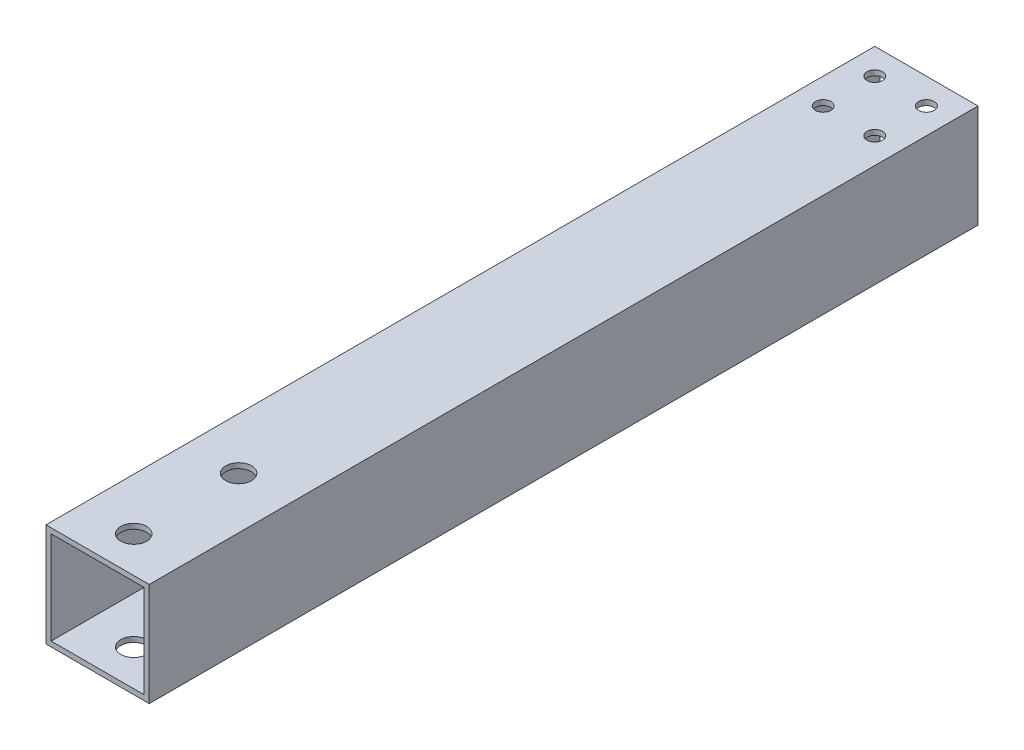
ISO-10303-21;
HEADER;
FILE_DESCRIPTION(('STEP AP214'),'2;1');
FILE_NAME('part.step','',(''),(''),'','','');
FILE_SCHEMA(('AUTOMOTIVE_DESIGN { 1 0 10303 214 1 1 1 1 }'));
ENDSEC;
DATA;
#1=APPLICATION_CONTEXT('core data for automotive mechanical design processes');
#2=APPLICATION_PROTOCOL_DEFINITION('international standard','automotive_design',2000,#1);
#3=PRODUCT_CONTEXT('',#1,'mechanical');
#4=PRODUCT('Part','Part','',(#3));
#5=PRODUCT_RELATED_PRODUCT_CATEGORY('part','',(#4));
#6=PRODUCT_DEFINITION_FORMATION('','',#4);
#7=PRODUCT_DEFINITION_CONTEXT('part definition',#1,'design');
#8=PRODUCT_DEFINITION('design','',#6,#7);
#9=PRODUCT_DEFINITION_SHAPE('','',#8);
#10=(LENGTH_UNIT() NAMED_UNIT(*) SI_UNIT(.MILLI.,.METRE.));
#11=(NAMED_UNIT(*) PLANE_ANGLE_UNIT() SI_UNIT($,.RADIAN.));
#12=(NAMED_UNIT(*) SI_UNIT($,.STERADIAN.) SOLID_ANGLE_UNIT());
#13=UNCERTAINTY_MEASURE_WITH_UNIT(LENGTH_MEASURE(1.E-05),#10,'distance_accuracy_value','');
#14=(GEOMETRIC_REPRESENTATION_CONTEXT(3) GLOBAL_UNCERTAINTY_ASSIGNED_CONTEXT((#13)) GLOBAL_UNIT_ASSIGNED_CONTEXT((#10,
#11,#12)) REPRESENTATION_CONTEXT('',''));
#15=CARTESIAN_POINT('',(0.,0.,0.));
#16=DIRECTION('',(0.,0.,1.));
#17=DIRECTION('',(1.,0.,0.));
#18=AXIS2_PLACEMENT_3D('',#15,#16,#17);
#19=CARTESIAN_POINT('',(10.,10.,171.98));
#20=DIRECTION('',(-1.,0.,0.));
#21=DIRECTION('',(0.,-1.,0.));
#22=AXIS2_PLACEMENT_3D('',#19,#20,#21);
#23=PLANE('',#22);
#24=DIRECTION('',(0.,1.,0.));
#25=VECTOR('',#24,1.);
#26=CARTESIAN_POINT('',(10.,-23.,160.58));
#27=LINE('',#26,#25);
#28=CARTESIAN_POINT('',(10.,-10.,160.58));
#29=VERTEX_POINT('',#28);
#30=CARTESIAN_POINT('',(10.,10.,160.58));
#31=VERTEX_POINT('',#30);
#32=EDGE_CURVE('E98',#29,#31,#27,.T.);
#33=ORIENTED_EDGE('',*,*,#32,.F.);
#34=DIRECTION('',(0.,0.,-1.));
#35=VECTOR('',#34,1.);
#36=CARTESIAN_POINT('',(10.,-10.,171.98));
#37=LINE('',#36,#35);
#38=CARTESIAN_POINT('',(10.,-10.,0.));
#39=VERTEX_POINT('',#38);
#40=EDGE_CURVE('E118',#29,#39,#37,.T.);
#41=ORIENTED_EDGE('',*,*,#40,.T.);
#42=DIRECTION('',(0.,1.,0.));
#43=VECTOR('',#42,1.);
#44=CARTESIAN_POINT('',(10.,10.,0.));
#45=LINE('',#44,#43);
#46=CARTESIAN_POINT('',(10.,10.,0.));
#47=VERTEX_POINT('',#46);
#48=EDGE_CURVE('E213',#39,#47,#45,.T.);
#49=ORIENTED_EDGE('',*,*,#48,.T.);
#50=DIRECTION('',(0.,0.,-1.));
#51=VECTOR('',#50,1.);
#52=CARTESIAN_POINT('',(10.,10.,171.98));
#53=LINE('',#52,#51);
#54=EDGE_CURVE('E41',#31,#47,#53,.T.);
#55=ORIENTED_EDGE('',*,*,#54,.F.);
#56=EDGE_LOOP('',(#33,#41,#49,#55));
#57=FACE_BOUND('',#56,.T.);
#58=ADVANCED_FACE('F34',(#57),#23,.F.);
#59=CARTESIAN_POINT('',(-9.99999999999999,10.,171.98));
#60=DIRECTION('',(0.,-1.,0.));
#61=DIRECTION('',(0.,0.,-1.));
#62=AXIS2_PLACEMENT_3D('',#59,#60,#61);
#63=PLANE('',#62);
#64=CARTESIAN_POINT('',(-4.99999999999999,10.,5.));
#65=DIRECTION('',(0.,1.,0.));
#66=DIRECTION('',(0.,0.,1.));
#67=AXIS2_PLACEMENT_3D('',#64,#65,#66);
#68=CIRCLE('',#67,1.5);
#69=CARTESIAN_POINT('',(-4.99999999999999,10.,6.5));
#70=VERTEX_POINT('',#69);
#71=EDGE_CURVE('E126',#70,#70,#68,.T.);
#72=ORIENTED_EDGE('',*,*,#71,.F.);
#73=EDGE_LOOP('',(#72));
#74=FACE_BOUND('',#73,.T.);
#75=CARTESIAN_POINT('',(5.00000000000001,10.,5.));
#76=DIRECTION('',(0.,1.,0.));
#77=DIRECTION('',(0.,0.,1.));
#78=AXIS2_PLACEMENT_3D('',#75,#76,#77);
#79=CIRCLE('',#78,1.5);
#80=CARTESIAN_POINT('',(5.00000000000001,10.,6.5));
#81=VERTEX_POINT('',#80);
#82=EDGE_CURVE('E169',#81,#81,#79,.T.);
#83=ORIENTED_EDGE('',*,*,#82,.F.);
#84=EDGE_LOOP('',(#83));
#85=FACE_BOUND('',#84,.T.);
#86=CARTESIAN_POINT('',(-4.99999999999999,10.,15.));
#87=DIRECTION('',(0.,1.,0.));
#88=DIRECTION('',(0.,0.,1.));
#89=AXIS2_PLACEMENT_3D('',#86,#87,#88);
#90=CIRCLE('',#89,1.5);
#91=CARTESIAN_POINT('',(-4.99999999999999,10.,16.5));
#92=VERTEX_POINT('',#91);
#93=EDGE_CURVE('E168',#92,#92,#90,.T.);
#94=ORIENTED_EDGE('',*,*,#93,.F.);
#95=EDGE_LOOP('',(#94));
#96=FACE_BOUND('',#95,.T.);
#97=CARTESIAN_POINT('',(5.00000000000001,10.,15.));
#98=DIRECTION('',(0.,1.,0.));
#99=DIRECTION('',(0.,0.,1.));
#100=AXIS2_PLACEMENT_3D('',#97,#98,#99);
#101=CIRCLE('',#100,1.5);
#102=CARTESIAN_POINT('',(5.00000000000001,10.,16.5));
#103=VERTEX_POINT('',#102);
#104=EDGE_CURVE('E165',#103,#103,#101,.T.);
#105=ORIENTED_EDGE('',*,*,#104,.F.);
#106=EDGE_LOOP('',(#105));
#107=FACE_BOUND('',#106,.T.);
#108=CARTESIAN_POINT('',(0.,10.,133.26));
#109=DIRECTION('',(0.,1.,0.));
#110=DIRECTION('',(0.,0.,1.));
#111=AXIS2_PLACEMENT_3D('',#108,#109,#110);
#112=CIRCLE('',#111,2.5);
#113=CARTESIAN_POINT('',(0.,10.,135.76));
#114=VERTEX_POINT('',#113);
#115=EDGE_CURVE('E259',#114,#114,#112,.T.);
#116=ORIENTED_EDGE('',*,*,#115,.F.);
#117=EDGE_LOOP('',(#116));
#118=FACE_BOUND('',#117,.T.);
#119=CARTESIAN_POINT('',(0.,10.,153.58));
#120=DIRECTION('',(0.,1.,0.));
#121=DIRECTION('',(0.,0.,1.));
#122=AXIS2_PLACEMENT_3D('',#119,#120,#121);
#123=CIRCLE('',#122,2.5);
#124=CARTESIAN_POINT('',(0.,10.,156.08));
#125=VERTEX_POINT('',#124);
#126=EDGE_CURVE('E145',#125,#125,#123,.T.);
#127=ORIENTED_EDGE('',*,*,#126,.F.);
#128=EDGE_LOOP('',(#127));
#129=FACE_BOUND('',#128,.T.);
#130=DIRECTION('',(1.,0.,0.));
#131=VECTOR('',#130,1.);
#132=CARTESIAN_POINT('',(-9.99999999999999,10.,160.58));
#133=LINE('',#132,#131);
#134=CARTESIAN_POINT('',(-9.99999999999999,10.,160.58));
#135=VERTEX_POINT('',#134);
#136=EDGE_CURVE('E95',#135,#31,#133,.T.);
#137=ORIENTED_EDGE('',*,*,#136,.T.);
#138=ORIENTED_EDGE('',*,*,#54,.T.);
#139=DIRECTION('',(-1.,0.,0.));
#140=VECTOR('',#139,1.);
#141=CARTESIAN_POINT('',(-9.99999999999999,10.,0.));
#142=LINE('',#141,#140);
#143=CARTESIAN_POINT('',(-9.99999999999999,10.,0.));
#144=VERTEX_POINT('',#143);
#145=EDGE_CURVE('E114',#47,#144,#142,.T.);
#146=ORIENTED_EDGE('',*,*,#145,.T.);
#147=DIRECTION('',(0.,0.,-1.));
#148=VECTOR('',#147,1.);
#149=CARTESIAN_POINT('',(-9.99999999999999,10.,171.98));
#150=LINE('',#149,#148);
#151=EDGE_CURVE('E107',#135,#144,#150,.T.);
#152=ORIENTED_EDGE('',*,*,#151,.F.);
#153=EDGE_LOOP('',(#137,#138,#146,#152));
#154=FACE_BOUND('',#153,.T.);
#155=ADVANCED_FACE('F112',(#74,#85,#96,#107,#118,#129,#154),#63,.F.);
#156=CARTESIAN_POINT('',(-9.99999999999999,10.,171.98));
#157=DIRECTION('',(1.,0.,0.));
#158=DIRECTION('',(0.,0.,-1.));
#159=AXIS2_PLACEMENT_3D('',#156,#157,#158);
#160=PLANE('',#159);
#161=DIRECTION('',(0.,1.,0.));
#162=VECTOR('',#161,1.);
#163=CARTESIAN_POINT('',(-9.99999999999999,-23.,160.58));
#164=LINE('',#163,#162);
#165=CARTESIAN_POINT('',(-9.99999999999999,-10.,160.58));
#166=VERTEX_POINT('',#165);
#167=EDGE_CURVE('E48',#166,#135,#164,.T.);
#168=ORIENTED_EDGE('',*,*,#167,.T.);
#169=ORIENTED_EDGE('',*,*,#151,.T.);
#170=DIRECTION('',(0.,-1.,0.));
#171=VECTOR('',#170,1.);
#172=CARTESIAN_POINT('',(-9.99999999999999,10.,0.));
#173=LINE('',#172,#171);
#174=CARTESIAN_POINT('',(-9.99999999999999,-10.,0.));
#175=VERTEX_POINT('',#174);
#176=EDGE_CURVE('E217',#144,#175,#173,.T.);
#177=ORIENTED_EDGE('',*,*,#176,.T.);
#178=DIRECTION('',(0.,0.,-1.));
#179=VECTOR('',#178,1.);
#180=CARTESIAN_POINT('',(-9.99999999999999,-10.,171.98));
#181=LINE('',#180,#179);
#182=EDGE_CURVE('E109',#166,#175,#181,.T.);
#183=ORIENTED_EDGE('',*,*,#182,.F.);
#184=EDGE_LOOP('',(#168,#169,#177,#183));
#185=FACE_BOUND('',#184,.T.);
#186=ADVANCED_FACE('F105',(#185),#160,.F.);
#187=CARTESIAN_POINT('',(-9.99999999999999,-10.,171.98));
#188=DIRECTION('',(0.,1.,0.));
#189=DIRECTION('',(0.,0.,1.));
#190=AXIS2_PLACEMENT_3D('',#187,#188,#189);
#191=PLANE('',#190);
#192=CARTESIAN_POINT('',(-4.99999999999999,-10.,5.));
#193=DIRECTION('',(0.,1.,0.));
#194=DIRECTION('',(0.,0.,1.));
#195=AXIS2_PLACEMENT_3D('',#192,#193,#194);
#196=CIRCLE('',#195,1.5);
#197=CARTESIAN_POINT('',(-4.99999999999999,-10.,6.5));
#198=VERTEX_POINT('',#197);
#199=EDGE_CURVE('E131',#198,#198,#196,.T.);
#200=ORIENTED_EDGE('',*,*,#199,.T.);
#201=EDGE_LOOP('',(#200));
#202=FACE_BOUND('',#201,.T.);
#203=CARTESIAN_POINT('',(5.00000000000001,-10.,5.));
#204=DIRECTION('',(0.,1.,0.));
#205=DIRECTION('',(0.,0.,1.));
#206=AXIS2_PLACEMENT_3D('',#203,#204,#205);
#207=CIRCLE('',#206,1.5);
#208=CARTESIAN_POINT('',(5.00000000000001,-10.,6.5));
#209=VERTEX_POINT('',#208);
#210=EDGE_CURVE('E136',#209,#209,#207,.T.);
#211=ORIENTED_EDGE('',*,*,#210,.T.);
#212=EDGE_LOOP('',(#211));
#213=FACE_BOUND('',#212,.T.);
#214=CARTESIAN_POINT('',(-4.99999999999999,-10.,15.));
#215=DIRECTION('',(0.,1.,0.));
#216=DIRECTION('',(0.,0.,1.));
#217=AXIS2_PLACEMENT_3D('',#214,#215,#216);
#218=CIRCLE('',#217,1.5);
#219=CARTESIAN_POINT('',(-4.99999999999999,-10.,16.5));
#220=VERTEX_POINT('',#219);
#221=EDGE_CURVE('E141',#220,#220,#218,.T.);
#222=ORIENTED_EDGE('',*,*,#221,.T.);
#223=EDGE_LOOP('',(#222));
#224=FACE_BOUND('',#223,.T.);
#225=CARTESIAN_POINT('',(5.00000000000001,-10.,15.));
#226=DIRECTION('',(0.,1.,0.));
#227=DIRECTION('',(0.,0.,1.));
#228=AXIS2_PLACEMENT_3D('',#225,#226,#227);
#229=CIRCLE('',#228,1.5);
#230=CARTESIAN_POINT('',(5.00000000000001,-10.,16.5));
#231=VERTEX_POINT('',#230);
#232=EDGE_CURVE('E190',#231,#231,#229,.T.);
#233=ORIENTED_EDGE('',*,*,#232,.T.);
#234=EDGE_LOOP('',(#233));
#235=FACE_BOUND('',#234,.T.);
#236=CARTESIAN_POINT('',(0.,-10.,133.26));
#237=DIRECTION('',(0.,1.,0.));
#238=DIRECTION('',(0.,0.,1.));
#239=AXIS2_PLACEMENT_3D('',#236,#237,#238);
#240=CIRCLE('',#239,2.5);
#241=CARTESIAN_POINT('',(0.,-10.,135.76));
#242=VERTEX_POINT('',#241);
#243=EDGE_CURVE('E149',#242,#242,#240,.T.);
#244=ORIENTED_EDGE('',*,*,#243,.T.);
#245=EDGE_LOOP('',(#244));
#246=FACE_BOUND('',#245,.T.);
#247=CARTESIAN_POINT('',(0.,-10.,153.58));
#248=DIRECTION('',(0.,1.,0.));
#249=DIRECTION('',(0.,0.,1.));
#250=AXIS2_PLACEMENT_3D('',#247,#248,#249);
#251=CIRCLE('',#250,2.5);
#252=CARTESIAN_POINT('',(0.,-10.,156.08));
#253=VERTEX_POINT('',#252);
#254=EDGE_CURVE('E153',#253,#253,#251,.T.);
#255=ORIENTED_EDGE('',*,*,#254,.T.);
#256=EDGE_LOOP('',(#255));
#257=FACE_BOUND('',#256,.T.);
#258=DIRECTION('',(1.,0.,0.));
#259=VECTOR('',#258,1.);
#260=CARTESIAN_POINT('',(-9.99999999999999,-10.,160.58));
#261=LINE('',#260,#259);
#262=EDGE_CURVE('E257',#166,#29,#261,.T.);
#263=ORIENTED_EDGE('',*,*,#262,.F.);
#264=ORIENTED_EDGE('',*,*,#182,.T.);
#265=DIRECTION('',(1.,0.,0.));
#266=VECTOR('',#265,1.);
#267=CARTESIAN_POINT('',(-9.99999999999999,-10.,0.));
#268=LINE('',#267,#266);
#269=EDGE_CURVE('E219',#175,#39,#268,.T.);
#270=ORIENTED_EDGE('',*,*,#269,.T.);
#271=ORIENTED_EDGE('',*,*,#40,.F.);
#272=EDGE_LOOP('',(#263,#264,#270,#271));
#273=FACE_BOUND('',#272,.T.);
#274=ADVANCED_FACE('F226',(#202,#213,#224,#235,#246,#257,#273),#191,.F.);
#275=CARTESIAN_POINT('',(9.00000000000001,9.,171.98));
#276=DIRECTION('',(-1.,0.,0.));
#277=DIRECTION('',(0.,-1.,0.));
#278=AXIS2_PLACEMENT_3D('',#275,#276,#277);
#279=PLANE('',#278);
#280=DIRECTION('',(0.,0.,-1.));
#281=VECTOR('',#280,1.);
#282=CARTESIAN_POINT('',(9.00000000000001,-9.,171.98));
#283=LINE('',#282,#281);
#284=CARTESIAN_POINT('',(9.00000000000001,-9.,160.58));
#285=VERTEX_POINT('',#284);
#286=CARTESIAN_POINT('',(9.00000000000001,-9.,0.));
#287=VERTEX_POINT('',#286);
#288=EDGE_CURVE('E205',#285,#287,#283,.T.);
#289=ORIENTED_EDGE('',*,*,#288,.F.);
#290=DIRECTION('',(0.,1.,0.));
#291=VECTOR('',#290,1.);
#292=CARTESIAN_POINT('',(9.00000000000001,9.,160.58));
#293=LINE('',#292,#291);
#294=CARTESIAN_POINT('',(9.,9.,160.58));
#295=VERTEX_POINT('',#294);
#296=EDGE_CURVE('E56',#285,#295,#293,.T.);
#297=ORIENTED_EDGE('',*,*,#296,.T.);
#298=DIRECTION('',(0.,0.,-1.));
#299=VECTOR('',#298,1.);
#300=CARTESIAN_POINT('',(9.00000000000001,9.,171.98));
#301=LINE('',#300,#299);
#302=CARTESIAN_POINT('',(9.00000000000001,9.,0.));
#303=VERTEX_POINT('',#302);
#304=EDGE_CURVE('E211',#295,#303,#301,.T.);
#305=ORIENTED_EDGE('',*,*,#304,.T.);
#306=DIRECTION('',(0.,1.,0.));
#307=VECTOR('',#306,1.);
#308=CARTESIAN_POINT('',(9.00000000000001,9.,0.));
#309=LINE('',#308,#307);
#310=EDGE_CURVE('E193',#287,#303,#309,.T.);
#311=ORIENTED_EDGE('',*,*,#310,.F.);
#312=EDGE_LOOP('',(#289,#297,#305,#311));
#313=FACE_BOUND('',#312,.T.);
#314=ADVANCED_FACE('F239',(#313),#279,.T.);
#315=CARTESIAN_POINT('',(-8.99999999999999,9.,171.98));
#316=DIRECTION('',(0.,-1.,0.));
#317=DIRECTION('',(0.,0.,-1.));
#318=AXIS2_PLACEMENT_3D('',#315,#316,#317);
#319=PLANE('',#318);
#320=CARTESIAN_POINT('',(0.,9.,153.58));
#321=DIRECTION('',(0.,-1.,0.));
#322=DIRECTION('',(0.,0.,-1.));
#323=AXIS2_PLACEMENT_3D('',#320,#321,#322);
#324=CIRCLE('',#323,2.5);
#325=CARTESIAN_POINT('',(0.,9.,151.08));
#326=VERTEX_POINT('',#325);
#327=EDGE_CURVE('E148',#326,#326,#324,.T.);
#328=ORIENTED_EDGE('',*,*,#327,.F.);
#329=EDGE_LOOP('',(#328));
#330=FACE_BOUND('',#329,.T.);
#331=CARTESIAN_POINT('',(0.,9.,133.26));
#332=DIRECTION('',(0.,-1.,0.));
#333=DIRECTION('',(0.,0.,-1.));
#334=AXIS2_PLACEMENT_3D('',#331,#332,#333);
#335=CIRCLE('',#334,2.5);
#336=CARTESIAN_POINT('',(0.,9.,130.76));
#337=VERTEX_POINT('',#336);
#338=EDGE_CURVE('E144',#337,#337,#335,.T.);
#339=ORIENTED_EDGE('',*,*,#338,.F.);
#340=EDGE_LOOP('',(#339));
#341=FACE_BOUND('',#340,.T.);
#342=CARTESIAN_POINT('',(5.00000000000001,9.,15.));
#343=DIRECTION('',(0.,-1.,0.));
#344=DIRECTION('',(0.,0.,-1.));
#345=AXIS2_PLACEMENT_3D('',#342,#343,#344);
#346=CIRCLE('',#345,1.5);
#347=CARTESIAN_POINT('',(5.00000000000001,9.,13.5));
#348=VERTEX_POINT('',#347);
#349=EDGE_CURVE('E140',#348,#348,#346,.T.);
#350=ORIENTED_EDGE('',*,*,#349,.F.);
#351=EDGE_LOOP('',(#350));
#352=FACE_BOUND('',#351,.T.);
#353=CARTESIAN_POINT('',(-4.99999999999999,9.,15.));
#354=DIRECTION('',(0.,-1.,0.));
#355=DIRECTION('',(0.,0.,-1.));
#356=AXIS2_PLACEMENT_3D('',#353,#354,#355);
#357=CIRCLE('',#356,1.5);
#358=CARTESIAN_POINT('',(-4.99999999999999,9.,13.5));
#359=VERTEX_POINT('',#358);
#360=EDGE_CURVE('E135',#359,#359,#357,.T.);
#361=ORIENTED_EDGE('',*,*,#360,.F.);
#362=EDGE_LOOP('',(#361));
#363=FACE_BOUND('',#362,.T.);
#364=CARTESIAN_POINT('',(5.00000000000001,9.,5.));
#365=DIRECTION('',(0.,-1.,0.));
#366=DIRECTION('',(0.,0.,-1.));
#367=AXIS2_PLACEMENT_3D('',#364,#365,#366);
#368=CIRCLE('',#367,1.5);
#369=CARTESIAN_POINT('',(5.00000000000001,9.,3.5));
#370=VERTEX_POINT('',#369);
#371=EDGE_CURVE('E130',#370,#370,#368,.T.);
#372=ORIENTED_EDGE('',*,*,#371,.F.);
#373=EDGE_LOOP('',(#372));
#374=FACE_BOUND('',#373,.T.);
#375=CARTESIAN_POINT('',(-4.99999999999999,9.,5.));
#376=DIRECTION('',(0.,-1.,0.));
#377=DIRECTION('',(0.,0.,-1.));
#378=AXIS2_PLACEMENT_3D('',#375,#376,#377);
#379=CIRCLE('',#378,1.5);
#380=CARTESIAN_POINT('',(-4.99999999999999,9.,3.5));
#381=VERTEX_POINT('',#380);
#382=EDGE_CURVE('E125',#381,#381,#379,.T.);
#383=ORIENTED_EDGE('',*,*,#382,.F.);
#384=EDGE_LOOP('',(#383));
#385=FACE_BOUND('',#384,.T.);
#386=ORIENTED_EDGE('',*,*,#304,.F.);
#387=DIRECTION('',(-1.,0.,0.));
#388=VECTOR('',#387,1.);
#389=CARTESIAN_POINT('',(-8.99999999999999,9.,160.58));
#390=LINE('',#389,#388);
#391=CARTESIAN_POINT('',(-8.99999999999999,9.,160.58));
#392=VERTEX_POINT('',#391);
#393=EDGE_CURVE('E246',#295,#392,#390,.T.);
#394=ORIENTED_EDGE('',*,*,#393,.T.);
#395=DIRECTION('',(0.,0.,-1.));
#396=VECTOR('',#395,1.);
#397=CARTESIAN_POINT('',(-8.99999999999999,9.,171.98));
#398=LINE('',#397,#396);
#399=CARTESIAN_POINT('',(-8.99999999999999,9.,0.));
#400=VERTEX_POINT('',#399);
#401=EDGE_CURVE('E209',#392,#400,#398,.T.);
#402=ORIENTED_EDGE('',*,*,#401,.T.);
#403=DIRECTION('',(-1.,0.,0.));
#404=VECTOR('',#403,1.);
#405=CARTESIAN_POINT('',(-8.99999999999999,9.,0.));
#406=LINE('',#405,#404);
#407=EDGE_CURVE('E196',#303,#400,#406,.T.);
#408=ORIENTED_EDGE('',*,*,#407,.F.);
#409=EDGE_LOOP('',(#386,#394,#402,#408));
#410=FACE_BOUND('',#409,.T.);
#411=ADVANCED_FACE('F243',(#330,#341,#352,#363,#374,#385,#410),#319,.T.);
#412=CARTESIAN_POINT('',(-8.99999999999999,9.,171.98));
#413=DIRECTION('',(1.,0.,0.));
#414=DIRECTION('',(0.,1.,0.));
#415=AXIS2_PLACEMENT_3D('',#412,#413,#414);
#416=PLANE('',#415);
#417=ORIENTED_EDGE('',*,*,#401,.F.);
#418=DIRECTION('',(0.,-1.,0.));
#419=VECTOR('',#418,1.);
#420=CARTESIAN_POINT('',(-8.99999999999999,9.,160.58));
#421=LINE('',#420,#419);
#422=CARTESIAN_POINT('',(-8.99999999999999,-9.,160.58));
#423=VERTEX_POINT('',#422);
#424=EDGE_CURVE('E110',#392,#423,#421,.T.);
#425=ORIENTED_EDGE('',*,*,#424,.T.);
#426=DIRECTION('',(0.,0.,-1.));
#427=VECTOR('',#426,1.);
#428=CARTESIAN_POINT('',(-8.99999999999999,-9.,171.98));
#429=LINE('',#428,#427);
#430=CARTESIAN_POINT('',(-8.99999999999999,-9.,0.));
#431=VERTEX_POINT('',#430);
#432=EDGE_CURVE('E207',#423,#431,#429,.T.);
#433=ORIENTED_EDGE('',*,*,#432,.T.);
#434=DIRECTION('',(0.,-1.,0.));
#435=VECTOR('',#434,1.);
#436=CARTESIAN_POINT('',(-8.99999999999999,9.,0.));
#437=LINE('',#436,#435);
#438=EDGE_CURVE('E199',#400,#431,#437,.T.);
#439=ORIENTED_EDGE('',*,*,#438,.F.);
#440=EDGE_LOOP('',(#417,#425,#433,#439));
#441=FACE_BOUND('',#440,.T.);
#442=ADVANCED_FACE('F249',(#441),#416,.T.);
#443=CARTESIAN_POINT('',(-8.99999999999999,-9.,171.98));
#444=DIRECTION('',(0.,1.,0.));
#445=DIRECTION('',(0.,0.,1.));
#446=AXIS2_PLACEMENT_3D('',#443,#444,#445);
#447=PLANE('',#446);
#448=CARTESIAN_POINT('',(0.,-9.,153.58));
#449=DIRECTION('',(0.,1.,0.));
#450=DIRECTION('',(0.,0.,1.));
#451=AXIS2_PLACEMENT_3D('',#448,#449,#450);
#452=CIRCLE('',#451,2.5);
#453=CARTESIAN_POINT('',(0.,-9.,156.08));
#454=VERTEX_POINT('',#453);
#455=EDGE_CURVE('E146',#454,#454,#452,.T.);
#456=ORIENTED_EDGE('',*,*,#455,.F.);
#457=EDGE_LOOP('',(#456));
#458=FACE_BOUND('',#457,.T.);
#459=CARTESIAN_POINT('',(0.,-9.,133.26));
#460=DIRECTION('',(0.,1.,0.));
#461=DIRECTION('',(0.,0.,1.));
#462=AXIS2_PLACEMENT_3D('',#459,#460,#461);
#463=CIRCLE('',#462,2.5);
#464=CARTESIAN_POINT('',(0.,-9.,135.76));
#465=VERTEX_POINT('',#464);
#466=EDGE_CURVE('E142',#465,#465,#463,.T.);
#467=ORIENTED_EDGE('',*,*,#466,.F.);
#468=EDGE_LOOP('',(#467));
#469=FACE_BOUND('',#468,.T.);
#470=CARTESIAN_POINT('',(5.00000000000001,-9.,15.));
#471=DIRECTION('',(0.,1.,0.));
#472=DIRECTION('',(0.,0.,1.));
#473=AXIS2_PLACEMENT_3D('',#470,#471,#472);
#474=CIRCLE('',#473,1.5);
#475=CARTESIAN_POINT('',(5.00000000000001,-9.,16.5));
#476=VERTEX_POINT('',#475);
#477=EDGE_CURVE('E137',#476,#476,#474,.T.);
#478=ORIENTED_EDGE('',*,*,#477,.F.);
#479=EDGE_LOOP('',(#478));
#480=FACE_BOUND('',#479,.T.);
#481=CARTESIAN_POINT('',(-4.99999999999999,-9.,15.));
#482=DIRECTION('',(0.,1.,0.));
#483=DIRECTION('',(0.,0.,1.));
#484=AXIS2_PLACEMENT_3D('',#481,#482,#483);
#485=CIRCLE('',#484,1.5);
#486=CARTESIAN_POINT('',(-4.99999999999999,-9.,16.5));
#487=VERTEX_POINT('',#486);
#488=EDGE_CURVE('E132',#487,#487,#485,.T.);
#489=ORIENTED_EDGE('',*,*,#488,.F.);
#490=EDGE_LOOP('',(#489));
#491=FACE_BOUND('',#490,.T.);
#492=CARTESIAN_POINT('',(5.00000000000001,-9.,5.));
#493=DIRECTION('',(0.,1.,0.));
#494=DIRECTION('',(0.,0.,1.));
#495=AXIS2_PLACEMENT_3D('',#492,#493,#494);
#496=CIRCLE('',#495,1.5);
#497=CARTESIAN_POINT('',(5.00000000000001,-9.,6.5));
#498=VERTEX_POINT('',#497);
#499=EDGE_CURVE('E127',#498,#498,#496,.T.);
#500=ORIENTED_EDGE('',*,*,#499,.F.);
#501=EDGE_LOOP('',(#500));
#502=FACE_BOUND('',#501,.T.);
#503=CARTESIAN_POINT('',(-4.99999999999999,-9.,5.));
#504=DIRECTION('',(0.,1.,0.));
#505=DIRECTION('',(0.,0.,1.));
#506=AXIS2_PLACEMENT_3D('',#503,#504,#505);
#507=CIRCLE('',#506,1.5);
#508=CARTESIAN_POINT('',(-4.99999999999999,-9.,6.5));
#509=VERTEX_POINT('',#508);
#510=EDGE_CURVE('E122',#509,#509,#507,.T.);
#511=ORIENTED_EDGE('',*,*,#510,.F.);
#512=EDGE_LOOP('',(#511));
#513=FACE_BOUND('',#512,.T.);
#514=ORIENTED_EDGE('',*,*,#432,.F.);
#515=DIRECTION('',(1.,0.,0.));
#516=VECTOR('',#515,1.);
#517=CARTESIAN_POINT('',(-8.99999999999999,-9.,160.58));
#518=LINE('',#517,#516);
#519=EDGE_CURVE('E11',#423,#285,#518,.T.);
#520=ORIENTED_EDGE('',*,*,#519,.T.);
#521=ORIENTED_EDGE('',*,*,#288,.T.);
#522=DIRECTION('',(1.,0.,0.));
#523=VECTOR('',#522,1.);
#524=CARTESIAN_POINT('',(-8.99999999999999,-9.,0.));
#525=LINE('',#524,#523);
#526=EDGE_CURVE('E202',#431,#287,#525,.T.);
#527=ORIENTED_EDGE('',*,*,#526,.F.);
#528=EDGE_LOOP('',(#514,#520,#521,#527));
#529=FACE_BOUND('',#528,.T.);
#530=ADVANCED_FACE('F232',(#458,#469,#480,#491,#502,#513,#529),#447,.T.);
#531=CARTESIAN_POINT('',(0.,0.,0.));
#532=DIRECTION('',(0.,0.,1.));
#533=DIRECTION('',(1.,0.,0.));
#534=AXIS2_PLACEMENT_3D('',#531,#532,#533);
#535=PLANE('',#534);
#536=ORIENTED_EDGE('',*,*,#48,.F.);
#537=ORIENTED_EDGE('',*,*,#269,.F.);
#538=ORIENTED_EDGE('',*,*,#176,.F.);
#539=ORIENTED_EDGE('',*,*,#145,.F.);
#540=EDGE_LOOP('',(#536,#537,#538,#539));
#541=FACE_BOUND('',#540,.T.);
#542=ORIENTED_EDGE('',*,*,#310,.T.);
#543=ORIENTED_EDGE('',*,*,#407,.T.);
#544=ORIENTED_EDGE('',*,*,#438,.T.);
#545=ORIENTED_EDGE('',*,*,#526,.T.);
#546=EDGE_LOOP('',(#542,#543,#544,#545));
#547=FACE_BOUND('',#546,.T.);
#548=ADVANCED_FACE('F228',(#541,#547),#535,.F.);
#549=CARTESIAN_POINT('',(-4.99999999999999,-40.,5.));
#550=DIRECTION('',(0.,1.,0.));
#551=DIRECTION('',(0.,0.,1.));
#552=AXIS2_PLACEMENT_3D('',#549,#550,#551);
#553=CYLINDRICAL_SURFACE('',#552,1.5);
#554=ORIENTED_EDGE('',*,*,#510,.T.);
#555=EDGE_LOOP('',(#554));
#556=FACE_BOUND('',#555,.T.);
#557=ORIENTED_EDGE('',*,*,#199,.F.);
#558=EDGE_LOOP('',(#557));
#559=FACE_BOUND('',#558,.T.);
#560=ADVANCED_FACE('F231',(#556,#559),#553,.F.);
#561=CARTESIAN_POINT('',(5.00000000000001,-40.,5.));
#562=DIRECTION('',(0.,1.,0.));
#563=DIRECTION('',(0.,0.,1.));
#564=AXIS2_PLACEMENT_3D('',#561,#562,#563);
#565=CYLINDRICAL_SURFACE('',#564,1.5);
#566=ORIENTED_EDGE('',*,*,#499,.T.);
#567=EDGE_LOOP('',(#566));
#568=FACE_BOUND('',#567,.T.);
#569=ORIENTED_EDGE('',*,*,#210,.F.);
#570=EDGE_LOOP('',(#569));
#571=FACE_BOUND('',#570,.T.);
#572=ADVANCED_FACE('F342',(#568,#571),#565,.F.);
#573=CARTESIAN_POINT('',(-4.99999999999999,-40.,15.));
#574=DIRECTION('',(0.,1.,0.));
#575=DIRECTION('',(0.,0.,1.));
#576=AXIS2_PLACEMENT_3D('',#573,#574,#575);
#577=CYLINDRICAL_SURFACE('',#576,1.5);
#578=ORIENTED_EDGE('',*,*,#488,.T.);
#579=EDGE_LOOP('',(#578));
#580=FACE_BOUND('',#579,.T.);
#581=ORIENTED_EDGE('',*,*,#221,.F.);
#582=EDGE_LOOP('',(#581));
#583=FACE_BOUND('',#582,.T.);
#584=ADVANCED_FACE('F351',(#580,#583),#577,.F.);
#585=CARTESIAN_POINT('',(5.00000000000001,-40.,15.));
#586=DIRECTION('',(0.,1.,0.));
#587=DIRECTION('',(0.,0.,1.));
#588=AXIS2_PLACEMENT_3D('',#585,#586,#587);
#589=CYLINDRICAL_SURFACE('',#588,1.5);
#590=ORIENTED_EDGE('',*,*,#477,.T.);
#591=EDGE_LOOP('',(#590));
#592=FACE_BOUND('',#591,.T.);
#593=ORIENTED_EDGE('',*,*,#232,.F.);
#594=EDGE_LOOP('',(#593));
#595=FACE_BOUND('',#594,.T.);
#596=ADVANCED_FACE('F360',(#592,#595),#589,.F.);
#597=ORIENTED_EDGE('',*,*,#382,.T.);
#598=EDGE_LOOP('',(#597));
#599=FACE_BOUND('',#598,.T.);
#600=ORIENTED_EDGE('',*,*,#71,.T.);
#601=EDGE_LOOP('',(#600));
#602=FACE_BOUND('',#601,.T.);
#603=ADVANCED_FACE('F345',(#599,#602),#553,.F.);
#604=ORIENTED_EDGE('',*,*,#371,.T.);
#605=EDGE_LOOP('',(#604));
#606=FACE_BOUND('',#605,.T.);
#607=ORIENTED_EDGE('',*,*,#82,.T.);
#608=EDGE_LOOP('',(#607));
#609=FACE_BOUND('',#608,.T.);
#610=ADVANCED_FACE('F354',(#606,#609),#565,.F.);
#611=ORIENTED_EDGE('',*,*,#360,.T.);
#612=EDGE_LOOP('',(#611));
#613=FACE_BOUND('',#612,.T.);
#614=ORIENTED_EDGE('',*,*,#93,.T.);
#615=EDGE_LOOP('',(#614));
#616=FACE_BOUND('',#615,.T.);
#617=ADVANCED_FACE('F363',(#613,#616),#577,.F.);
#618=ORIENTED_EDGE('',*,*,#349,.T.);
#619=EDGE_LOOP('',(#618));
#620=FACE_BOUND('',#619,.T.);
#621=ORIENTED_EDGE('',*,*,#104,.T.);
#622=EDGE_LOOP('',(#621));
#623=FACE_BOUND('',#622,.T.);
#624=ADVANCED_FACE('F371',(#620,#623),#589,.F.);
#625=CARTESIAN_POINT('',(0.,-26.,133.26));
#626=DIRECTION('',(0.,1.,0.));
#627=DIRECTION('',(0.,0.,1.));
#628=AXIS2_PLACEMENT_3D('',#625,#626,#627);
#629=CYLINDRICAL_SURFACE('',#628,2.5);
#630=ORIENTED_EDGE('',*,*,#466,.T.);
#631=EDGE_LOOP('',(#630));
#632=FACE_BOUND('',#631,.T.);
#633=ORIENTED_EDGE('',*,*,#243,.F.);
#634=EDGE_LOOP('',(#633));
#635=FACE_BOUND('',#634,.T.);
#636=ADVANCED_FACE('F283',(#632,#635),#629,.F.);
#637=CARTESIAN_POINT('',(0.,-26.,153.58));
#638=DIRECTION('',(0.,1.,0.));
#639=DIRECTION('',(0.,0.,1.));
#640=AXIS2_PLACEMENT_3D('',#637,#638,#639);
#641=CYLINDRICAL_SURFACE('',#640,2.5);
#642=ORIENTED_EDGE('',*,*,#455,.T.);
#643=EDGE_LOOP('',(#642));
#644=FACE_BOUND('',#643,.T.);
#645=ORIENTED_EDGE('',*,*,#254,.F.);
#646=EDGE_LOOP('',(#645));
#647=FACE_BOUND('',#646,.T.);
#648=ADVANCED_FACE('F275',(#644,#647),#641,.F.);
#649=ORIENTED_EDGE('',*,*,#338,.T.);
#650=EDGE_LOOP('',(#649));
#651=FACE_BOUND('',#650,.T.);
#652=ORIENTED_EDGE('',*,*,#115,.T.);
#653=EDGE_LOOP('',(#652));
#654=FACE_BOUND('',#653,.T.);
#655=ADVANCED_FACE('F264',(#651,#654),#629,.F.);
#656=ORIENTED_EDGE('',*,*,#327,.T.);
#657=EDGE_LOOP('',(#656));
#658=FACE_BOUND('',#657,.T.);
#659=ORIENTED_EDGE('',*,*,#126,.T.);
#660=EDGE_LOOP('',(#659));
#661=FACE_BOUND('',#660,.T.);
#662=ADVANCED_FACE('F271',(#658,#661),#641,.F.);
#663=CARTESIAN_POINT('',(-9.99999999999999,-23.,160.58));
#664=DIRECTION('',(0.,0.,1.));
#665=DIRECTION('',(1.,0.,0.));
#666=AXIS2_PLACEMENT_3D('',#663,#664,#665);
#667=PLANE('',#666);
#668=ORIENTED_EDGE('',*,*,#519,.F.);
#669=ORIENTED_EDGE('',*,*,#424,.F.);
#670=ORIENTED_EDGE('',*,*,#393,.F.);
#671=ORIENTED_EDGE('',*,*,#296,.F.);
#672=EDGE_LOOP('',(#668,#669,#670,#671));
#673=FACE_BOUND('',#672,.T.);
#674=ORIENTED_EDGE('',*,*,#262,.T.);
#675=ORIENTED_EDGE('',*,*,#32,.T.);
#676=ORIENTED_EDGE('',*,*,#136,.F.);
#677=ORIENTED_EDGE('',*,*,#167,.F.);
#678=EDGE_LOOP('',(#674,#675,#676,#677));
#679=FACE_BOUND('',#678,.T.);
#680=ADVANCED_FACE('F96',(#673,#679),#667,.T.);
#681=CLOSED_SHELL('',(#58,#155,#186,#274,#314,#411,#442,#530,#548,#560,#572,#584,#596,#603,#610,
#617,#624,#636,#648,#655,#662,#680));
#682=MANIFOLD_SOLID_BREP('B2',#681);
#683=ADVANCED_BREP_SHAPE_REPRESENTATION('',(#18,#682),#14);
#684=SHAPE_DEFINITION_REPRESENTATION(#9,#683);
ENDSEC;
END-ISO-10303-21;
